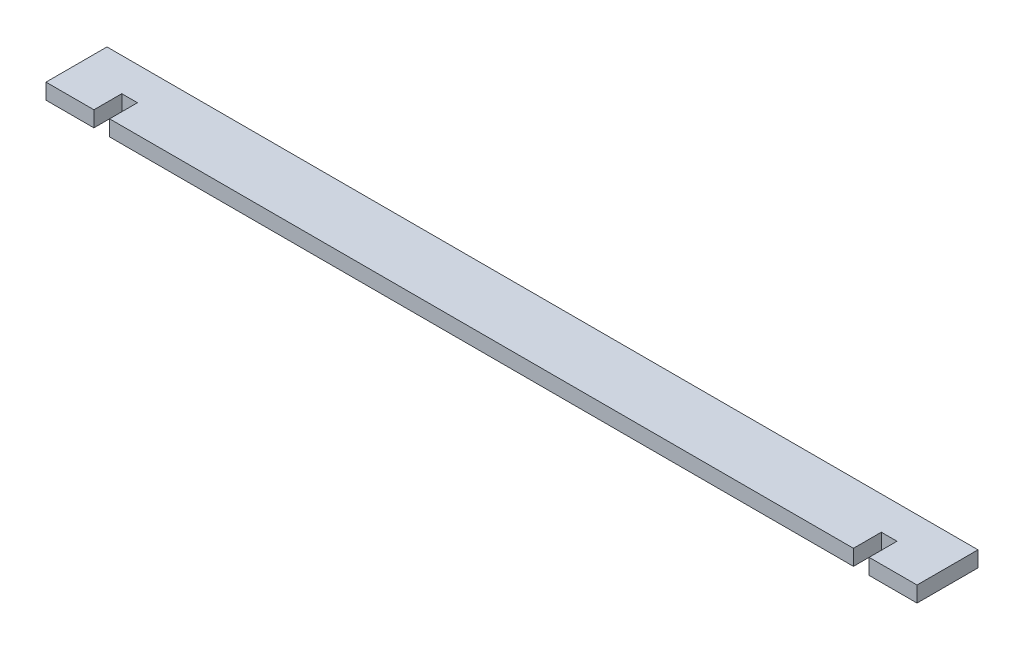
ISO-10303-21;
HEADER;
FILE_DESCRIPTION(('STEP AP214'),'2;1');
FILE_NAME('part.step','',(''),(''),'','','');
FILE_SCHEMA(('AUTOMOTIVE_DESIGN { 1 0 10303 214 1 1 1 1 }'));
ENDSEC;
DATA;
#1=APPLICATION_CONTEXT('core data for automotive mechanical design processes');
#2=APPLICATION_PROTOCOL_DEFINITION('international standard','automotive_design',2000,#1);
#3=PRODUCT_CONTEXT('',#1,'mechanical');
#4=PRODUCT('Part','Part','',(#3));
#5=PRODUCT_RELATED_PRODUCT_CATEGORY('part','',(#4));
#6=PRODUCT_DEFINITION_FORMATION('','',#4);
#7=PRODUCT_DEFINITION_CONTEXT('part definition',#1,'design');
#8=PRODUCT_DEFINITION('design','',#6,#7);
#9=PRODUCT_DEFINITION_SHAPE('','',#8);
#10=(LENGTH_UNIT() NAMED_UNIT(*) SI_UNIT(.MILLI.,.METRE.));
#11=(NAMED_UNIT(*) PLANE_ANGLE_UNIT() SI_UNIT($,.RADIAN.));
#12=(NAMED_UNIT(*) SI_UNIT($,.STERADIAN.) SOLID_ANGLE_UNIT());
#13=UNCERTAINTY_MEASURE_WITH_UNIT(LENGTH_MEASURE(1.E-05),#10,'distance_accuracy_value','');
#14=(GEOMETRIC_REPRESENTATION_CONTEXT(3) GLOBAL_UNCERTAINTY_ASSIGNED_CONTEXT((#13)) GLOBAL_UNIT_ASSIGNED_CONTEXT((#10,
#11,#12)) REPRESENTATION_CONTEXT('',''));
#15=CARTESIAN_POINT('',(0.,0.,0.));
#16=DIRECTION('',(0.,0.,1.));
#17=DIRECTION('',(1.,0.,0.));
#18=AXIS2_PLACEMENT_3D('',#15,#16,#17);
#19=CARTESIAN_POINT('',(0.,18.,0.));
#20=DIRECTION('',(-1.,0.,0.));
#21=DIRECTION('',(0.,0.,1.));
#22=AXIS2_PLACEMENT_3D('',#19,#20,#21);
#23=PLANE('',#22);
#24=DIRECTION('',(0.,0.,-1.));
#25=VECTOR('',#24,1.);
#26=CARTESIAN_POINT('',(0.,0.,0.));
#27=LINE('',#26,#25);
#28=CARTESIAN_POINT('',(0.,0.,0.));
#29=VERTEX_POINT('',#28);
#30=CARTESIAN_POINT('',(0.,0.,-70.0000000000002));
#31=VERTEX_POINT('',#30);
#32=EDGE_CURVE('E153',#29,#31,#27,.T.);
#33=ORIENTED_EDGE('',*,*,#32,.T.);
#34=DIRECTION('',(0.,-1.,0.));
#35=VECTOR('',#34,1.);
#36=CARTESIAN_POINT('',(0.,18.,-70.0000000000002));
#37=LINE('',#36,#35);
#38=CARTESIAN_POINT('',(0.,18.,-70.0000000000002));
#39=VERTEX_POINT('',#38);
#40=EDGE_CURVE('E11',#39,#31,#37,.T.);
#41=ORIENTED_EDGE('',*,*,#40,.F.);
#42=DIRECTION('',(0.,0.,-1.));
#43=VECTOR('',#42,1.);
#44=CARTESIAN_POINT('',(0.,18.,0.));
#45=LINE('',#44,#43);
#46=CARTESIAN_POINT('',(0.,18.,0.));
#47=VERTEX_POINT('',#46);
#48=EDGE_CURVE('E175',#47,#39,#45,.T.);
#49=ORIENTED_EDGE('',*,*,#48,.F.);
#50=DIRECTION('',(0.,-1.,0.));
#51=VECTOR('',#50,1.);
#52=CARTESIAN_POINT('',(0.,18.,0.));
#53=LINE('',#52,#51);
#54=EDGE_CURVE('E149',#47,#29,#53,.T.);
#55=ORIENTED_EDGE('',*,*,#54,.T.);
#56=EDGE_LOOP('',(#33,#41,#49,#55));
#57=FACE_BOUND('',#56,.T.);
#58=ADVANCED_FACE('F33',(#57),#23,.F.);
#59=CARTESIAN_POINT('',(0.,18.,-70.0000000000002));
#60=DIRECTION('',(0.,0.,1.));
#61=DIRECTION('',(1.,0.,0.));
#62=AXIS2_PLACEMENT_3D('',#59,#60,#61);
#63=PLANE('',#62);
#64=DIRECTION('',(-1.,0.,0.));
#65=VECTOR('',#64,1.);
#66=CARTESIAN_POINT('',(0.,0.,-70.0000000000002));
#67=LINE('',#66,#65);
#68=CARTESIAN_POINT('',(-1000.,0.,-70.));
#69=VERTEX_POINT('',#68);
#70=EDGE_CURVE('E156',#31,#69,#67,.T.);
#71=ORIENTED_EDGE('',*,*,#70,.T.);
#72=DIRECTION('',(0.,-1.,0.));
#73=VECTOR('',#72,1.);
#74=CARTESIAN_POINT('',(-1000.,18.,-70.));
#75=LINE('',#74,#73);
#76=CARTESIAN_POINT('',(-1000.,18.,-70.));
#77=VERTEX_POINT('',#76);
#78=EDGE_CURVE('E41',#77,#69,#75,.T.);
#79=ORIENTED_EDGE('',*,*,#78,.F.);
#80=DIRECTION('',(-1.,0.,0.));
#81=VECTOR('',#80,1.);
#82=CARTESIAN_POINT('',(0.,18.,-70.0000000000002));
#83=LINE('',#82,#81);
#84=EDGE_CURVE('E104',#39,#77,#83,.T.);
#85=ORIENTED_EDGE('',*,*,#84,.F.);
#86=ORIENTED_EDGE('',*,*,#40,.T.);
#87=EDGE_LOOP('',(#71,#79,#85,#86));
#88=FACE_BOUND('',#87,.T.);
#89=ADVANCED_FACE('F253',(#88),#63,.F.);
#90=CARTESIAN_POINT('',(-1000.,18.,1.08993565124114E-13));
#91=DIRECTION('',(1.,0.,0.));
#92=DIRECTION('',(0.,0.,-1.));
#93=AXIS2_PLACEMENT_3D('',#90,#91,#92);
#94=PLANE('',#93);
#95=DIRECTION('',(0.,0.,1.));
#96=VECTOR('',#95,1.);
#97=CARTESIAN_POINT('',(-1000.,0.,1.08993565124114E-13));
#98=LINE('',#97,#96);
#99=CARTESIAN_POINT('',(-1000.,0.,1.08993565124114E-13));
#100=VERTEX_POINT('',#99);
#101=EDGE_CURVE('E158',#69,#100,#98,.T.);
#102=ORIENTED_EDGE('',*,*,#101,.T.);
#103=DIRECTION('',(0.,-1.,0.));
#104=VECTOR('',#103,1.);
#105=CARTESIAN_POINT('',(-1000.,18.,1.08993565124114E-13));
#106=LINE('',#105,#104);
#107=CARTESIAN_POINT('',(-1000.,18.,1.08993565124114E-13));
#108=VERTEX_POINT('',#107);
#109=EDGE_CURVE('E194',#108,#100,#106,.T.);
#110=ORIENTED_EDGE('',*,*,#109,.F.);
#111=DIRECTION('',(0.,0.,1.));
#112=VECTOR('',#111,1.);
#113=CARTESIAN_POINT('',(-1000.,18.,1.08993565124114E-13));
#114=LINE('',#113,#112);
#115=EDGE_CURVE('E202',#77,#108,#114,.T.);
#116=ORIENTED_EDGE('',*,*,#115,.F.);
#117=ORIENTED_EDGE('',*,*,#78,.T.);
#118=EDGE_LOOP('',(#102,#110,#116,#117));
#119=FACE_BOUND('',#118,.T.);
#120=ADVANCED_FACE('F200',(#119),#94,.F.);
#121=CARTESIAN_POINT('',(-945.,18.,1.15729122519425E-13));
#122=DIRECTION('',(0.,0.,-1.));
#123=DIRECTION('',(-1.,0.,0.));
#124=AXIS2_PLACEMENT_3D('',#121,#122,#123);
#125=PLANE('',#124);
#126=DIRECTION('',(1.,0.,0.));
#127=VECTOR('',#126,1.);
#128=CARTESIAN_POINT('',(-945.,0.,1.15729122519425E-13));
#129=LINE('',#128,#127);
#130=CARTESIAN_POINT('',(-945.,0.,1.15729122519425E-13));
#131=VERTEX_POINT('',#130);
#132=EDGE_CURVE('E160',#100,#131,#129,.T.);
#133=ORIENTED_EDGE('',*,*,#132,.T.);
#134=DIRECTION('',(0.,-1.,0.));
#135=VECTOR('',#134,1.);
#136=CARTESIAN_POINT('',(-945.,18.,1.15729122519425E-13));
#137=LINE('',#136,#135);
#138=CARTESIAN_POINT('',(-945.,18.,1.15729122519425E-13));
#139=VERTEX_POINT('',#138);
#140=EDGE_CURVE('E191',#139,#131,#137,.T.);
#141=ORIENTED_EDGE('',*,*,#140,.F.);
#142=DIRECTION('',(1.,0.,0.));
#143=VECTOR('',#142,1.);
#144=CARTESIAN_POINT('',(-945.,18.,1.15729122519425E-13));
#145=LINE('',#144,#143);
#146=EDGE_CURVE('E220',#108,#139,#145,.T.);
#147=ORIENTED_EDGE('',*,*,#146,.F.);
#148=ORIENTED_EDGE('',*,*,#109,.T.);
#149=EDGE_LOOP('',(#133,#141,#147,#148));
#150=FACE_BOUND('',#149,.T.);
#151=ADVANCED_FACE('F211',(#150),#125,.F.);
#152=CARTESIAN_POINT('',(-945.,18.,1.15729122519425E-13));
#153=DIRECTION('',(-1.,0.,0.));
#154=DIRECTION('',(0.,0.,1.));
#155=AXIS2_PLACEMENT_3D('',#152,#153,#154);
#156=PLANE('',#155);
#157=DIRECTION('',(0.,0.,-1.));
#158=VECTOR('',#157,1.);
#159=CARTESIAN_POINT('',(-945.,0.,1.15729122519425E-13));
#160=LINE('',#159,#158);
#161=CARTESIAN_POINT('',(-945.,0.,-31.9999999999999));
#162=VERTEX_POINT('',#161);
#163=EDGE_CURVE('E162',#131,#162,#160,.T.);
#164=ORIENTED_EDGE('',*,*,#163,.T.);
#165=DIRECTION('',(0.,-1.,0.));
#166=VECTOR('',#165,1.);
#167=CARTESIAN_POINT('',(-945.,18.,-31.9999999999999));
#168=LINE('',#167,#166);
#169=CARTESIAN_POINT('',(-945.,18.,-31.9999999999999));
#170=VERTEX_POINT('',#169);
#171=EDGE_CURVE('E188',#170,#162,#168,.T.);
#172=ORIENTED_EDGE('',*,*,#171,.F.);
#173=DIRECTION('',(0.,0.,-1.));
#174=VECTOR('',#173,1.);
#175=CARTESIAN_POINT('',(-945.,18.,1.15729122519425E-13));
#176=LINE('',#175,#174);
#177=EDGE_CURVE('E217',#139,#170,#176,.T.);
#178=ORIENTED_EDGE('',*,*,#177,.F.);
#179=ORIENTED_EDGE('',*,*,#140,.T.);
#180=EDGE_LOOP('',(#164,#172,#178,#179));
#181=FACE_BOUND('',#180,.T.);
#182=ADVANCED_FACE('F215',(#181),#156,.F.);
#183=CARTESIAN_POINT('',(-945.,18.,-31.9999999999999));
#184=DIRECTION('',(0.,0.,-1.));
#185=DIRECTION('',(-1.,0.,0.));
#186=AXIS2_PLACEMENT_3D('',#183,#184,#185);
#187=PLANE('',#186);
#188=DIRECTION('',(1.,0.,0.));
#189=VECTOR('',#188,1.);
#190=CARTESIAN_POINT('',(-945.,0.,-31.9999999999999));
#191=LINE('',#190,#189);
#192=CARTESIAN_POINT('',(-927.,0.,-31.9999999999999));
#193=VERTEX_POINT('',#192);
#194=EDGE_CURVE('E164',#162,#193,#191,.T.);
#195=ORIENTED_EDGE('',*,*,#194,.T.);
#196=DIRECTION('',(0.,-1.,0.));
#197=VECTOR('',#196,1.);
#198=CARTESIAN_POINT('',(-927.,18.,-31.9999999999999));
#199=LINE('',#198,#197);
#200=CARTESIAN_POINT('',(-927.,18.,-31.9999999999999));
#201=VERTEX_POINT('',#200);
#202=EDGE_CURVE('E185',#201,#193,#199,.T.);
#203=ORIENTED_EDGE('',*,*,#202,.F.);
#204=DIRECTION('',(1.,0.,0.));
#205=VECTOR('',#204,1.);
#206=CARTESIAN_POINT('',(-945.,18.,-31.9999999999999));
#207=LINE('',#206,#205);
#208=EDGE_CURVE('E219',#170,#201,#207,.T.);
#209=ORIENTED_EDGE('',*,*,#208,.F.);
#210=ORIENTED_EDGE('',*,*,#171,.T.);
#211=EDGE_LOOP('',(#195,#203,#209,#210));
#212=FACE_BOUND('',#211,.T.);
#213=ADVANCED_FACE('F266',(#212),#187,.F.);
#214=CARTESIAN_POINT('',(-927.,18.,1.15729122519425E-13));
#215=DIRECTION('',(1.,0.,0.));
#216=DIRECTION('',(0.,0.,-1.));
#217=AXIS2_PLACEMENT_3D('',#214,#215,#216);
#218=PLANE('',#217);
#219=DIRECTION('',(0.,0.,1.));
#220=VECTOR('',#219,1.);
#221=CARTESIAN_POINT('',(-927.,0.,1.15729122519425E-13));
#222=LINE('',#221,#220);
#223=CARTESIAN_POINT('',(-927.,0.,1.15729122519425E-13));
#224=VERTEX_POINT('',#223);
#225=EDGE_CURVE('E166',#193,#224,#222,.T.);
#226=ORIENTED_EDGE('',*,*,#225,.T.);
#227=DIRECTION('',(0.,-1.,0.));
#228=VECTOR('',#227,1.);
#229=CARTESIAN_POINT('',(-927.,18.,1.15729122519425E-13));
#230=LINE('',#229,#228);
#231=CARTESIAN_POINT('',(-927.,18.,1.15729122519425E-13));
#232=VERTEX_POINT('',#231);
#233=EDGE_CURVE('E182',#232,#224,#230,.T.);
#234=ORIENTED_EDGE('',*,*,#233,.F.);
#235=DIRECTION('',(0.,0.,1.));
#236=VECTOR('',#235,1.);
#237=CARTESIAN_POINT('',(-927.,18.,1.15729122519425E-13));
#238=LINE('',#237,#236);
#239=EDGE_CURVE('E222',#201,#232,#238,.T.);
#240=ORIENTED_EDGE('',*,*,#239,.F.);
#241=ORIENTED_EDGE('',*,*,#202,.T.);
#242=EDGE_LOOP('',(#226,#234,#240,#241));
#243=FACE_BOUND('',#242,.T.);
#244=ADVANCED_FACE('F269',(#243),#218,.F.);
#245=CARTESIAN_POINT('',(-73.,18.,1.15729122519425E-13));
#246=DIRECTION('',(0.,0.,-1.));
#247=DIRECTION('',(-1.,0.,0.));
#248=AXIS2_PLACEMENT_3D('',#245,#246,#247);
#249=PLANE('',#248);
#250=DIRECTION('',(1.,0.,0.));
#251=VECTOR('',#250,1.);
#252=CARTESIAN_POINT('',(-73.,0.,1.15729122519425E-13));
#253=LINE('',#252,#251);
#254=CARTESIAN_POINT('',(-73.,0.,1.15729122519425E-13));
#255=VERTEX_POINT('',#254);
#256=EDGE_CURVE('E168',#224,#255,#253,.T.);
#257=ORIENTED_EDGE('',*,*,#256,.T.);
#258=DIRECTION('',(0.,-1.,0.));
#259=VECTOR('',#258,1.);
#260=CARTESIAN_POINT('',(-73.,18.,1.15729122519425E-13));
#261=LINE('',#260,#259);
#262=CARTESIAN_POINT('',(-73.,18.,1.15729122519425E-13));
#263=VERTEX_POINT('',#262);
#264=EDGE_CURVE('E179',#263,#255,#261,.T.);
#265=ORIENTED_EDGE('',*,*,#264,.F.);
#266=DIRECTION('',(1.,0.,0.));
#267=VECTOR('',#266,1.);
#268=CARTESIAN_POINT('',(-73.,18.,1.15729122519425E-13));
#269=LINE('',#268,#267);
#270=EDGE_CURVE('E228',#232,#263,#269,.T.);
#271=ORIENTED_EDGE('',*,*,#270,.F.);
#272=ORIENTED_EDGE('',*,*,#233,.T.);
#273=EDGE_LOOP('',(#257,#265,#271,#272));
#274=FACE_BOUND('',#273,.T.);
#275=ADVANCED_FACE('F234',(#274),#249,.F.);
#276=CARTESIAN_POINT('',(-73.,18.,1.15729122519425E-13));
#277=DIRECTION('',(-1.,0.,0.));
#278=DIRECTION('',(0.,0.,1.));
#279=AXIS2_PLACEMENT_3D('',#276,#277,#278);
#280=PLANE('',#279);
#281=DIRECTION('',(0.,0.,-1.));
#282=VECTOR('',#281,1.);
#283=CARTESIAN_POINT('',(-73.,0.,1.15729122519425E-13));
#284=LINE('',#283,#282);
#285=CARTESIAN_POINT('',(-73.,0.,-31.9999999999999));
#286=VERTEX_POINT('',#285);
#287=EDGE_CURVE('E170',#255,#286,#284,.T.);
#288=ORIENTED_EDGE('',*,*,#287,.T.);
#289=DIRECTION('',(0.,-1.,0.));
#290=VECTOR('',#289,1.);
#291=CARTESIAN_POINT('',(-73.,18.,-31.9999999999999));
#292=LINE('',#291,#290);
#293=CARTESIAN_POINT('',(-73.,18.,-31.9999999999999));
#294=VERTEX_POINT('',#293);
#295=EDGE_CURVE('E144',#294,#286,#292,.T.);
#296=ORIENTED_EDGE('',*,*,#295,.F.);
#297=DIRECTION('',(0.,0.,-1.));
#298=VECTOR('',#297,1.);
#299=CARTESIAN_POINT('',(-73.,18.,1.15729122519425E-13));
#300=LINE('',#299,#298);
#301=EDGE_CURVE('E135',#263,#294,#300,.T.);
#302=ORIENTED_EDGE('',*,*,#301,.F.);
#303=ORIENTED_EDGE('',*,*,#264,.T.);
#304=EDGE_LOOP('',(#288,#296,#302,#303));
#305=FACE_BOUND('',#304,.T.);
#306=ADVANCED_FACE('F238',(#305),#280,.F.);
#307=CARTESIAN_POINT('',(-54.9999999999999,18.,-31.9999999999999));
#308=DIRECTION('',(0.,0.,-1.));
#309=DIRECTION('',(-1.,0.,0.));
#310=AXIS2_PLACEMENT_3D('',#307,#308,#309);
#311=PLANE('',#310);
#312=DIRECTION('',(1.,0.,0.));
#313=VECTOR('',#312,1.);
#314=CARTESIAN_POINT('',(-54.9999999999999,0.,-31.9999999999999));
#315=LINE('',#314,#313);
#316=CARTESIAN_POINT('',(-54.9999999999999,0.,-31.9999999999999));
#317=VERTEX_POINT('',#316);
#318=EDGE_CURVE('E143',#286,#317,#315,.T.);
#319=ORIENTED_EDGE('',*,*,#318,.T.);
#320=DIRECTION('',(0.,-1.,0.));
#321=VECTOR('',#320,1.);
#322=CARTESIAN_POINT('',(-54.9999999999999,18.,-31.9999999999999));
#323=LINE('',#322,#321);
#324=CARTESIAN_POINT('',(-54.9999999999999,18.,-31.9999999999999));
#325=VERTEX_POINT('',#324);
#326=EDGE_CURVE('E140',#325,#317,#323,.T.);
#327=ORIENTED_EDGE('',*,*,#326,.F.);
#328=DIRECTION('',(1.,0.,0.));
#329=VECTOR('',#328,1.);
#330=CARTESIAN_POINT('',(-54.9999999999999,18.,-31.9999999999999));
#331=LINE('',#330,#329);
#332=EDGE_CURVE('E129',#294,#325,#331,.T.);
#333=ORIENTED_EDGE('',*,*,#332,.F.);
#334=ORIENTED_EDGE('',*,*,#295,.T.);
#335=EDGE_LOOP('',(#319,#327,#333,#334));
#336=FACE_BOUND('',#335,.T.);
#337=ADVANCED_FACE('F141',(#336),#311,.F.);
#338=CARTESIAN_POINT('',(-54.9999999999999,18.,1.15729122519425E-13));
#339=DIRECTION('',(1.,0.,0.));
#340=DIRECTION('',(0.,0.,-1.));
#341=AXIS2_PLACEMENT_3D('',#338,#339,#340);
#342=PLANE('',#341);
#343=DIRECTION('',(0.,0.,1.));
#344=VECTOR('',#343,1.);
#345=CARTESIAN_POINT('',(-54.9999999999999,0.,1.15729122519425E-13));
#346=LINE('',#345,#344);
#347=CARTESIAN_POINT('',(-54.9999999999999,0.,1.15729122519425E-13));
#348=VERTEX_POINT('',#347);
#349=EDGE_CURVE('E90',#317,#348,#346,.T.);
#350=ORIENTED_EDGE('',*,*,#349,.T.);
#351=DIRECTION('',(0.,-1.,0.));
#352=VECTOR('',#351,1.);
#353=CARTESIAN_POINT('',(-54.9999999999999,18.,1.15729122519425E-13));
#354=LINE('',#353,#352);
#355=CARTESIAN_POINT('',(-54.9999999999999,18.,1.15729122519425E-13));
#356=VERTEX_POINT('',#355);
#357=EDGE_CURVE('E145',#356,#348,#354,.T.);
#358=ORIENTED_EDGE('',*,*,#357,.F.);
#359=DIRECTION('',(0.,0.,1.));
#360=VECTOR('',#359,1.);
#361=CARTESIAN_POINT('',(-54.9999999999999,18.,1.15729122519425E-13));
#362=LINE('',#361,#360);
#363=EDGE_CURVE('E133',#325,#356,#362,.T.);
#364=ORIENTED_EDGE('',*,*,#363,.F.);
#365=ORIENTED_EDGE('',*,*,#326,.T.);
#366=EDGE_LOOP('',(#350,#358,#364,#365));
#367=FACE_BOUND('',#366,.T.);
#368=ADVANCED_FACE('F147',(#367),#342,.F.);
#369=CARTESIAN_POINT('',(0.,18.,0.));
#370=DIRECTION('',(0.,0.,-1.));
#371=DIRECTION('',(-1.,0.,0.));
#372=AXIS2_PLACEMENT_3D('',#369,#370,#371);
#373=PLANE('',#372);
#374=DIRECTION('',(1.,0.,0.));
#375=VECTOR('',#374,1.);
#376=CARTESIAN_POINT('',(0.,0.,0.));
#377=LINE('',#376,#375);
#378=EDGE_CURVE('E96',#348,#29,#377,.T.);
#379=ORIENTED_EDGE('',*,*,#378,.T.);
#380=ORIENTED_EDGE('',*,*,#54,.F.);
#381=DIRECTION('',(1.,0.,0.));
#382=VECTOR('',#381,1.);
#383=CARTESIAN_POINT('',(0.,18.,0.));
#384=LINE('',#383,#382);
#385=EDGE_CURVE('E49',#356,#47,#384,.T.);
#386=ORIENTED_EDGE('',*,*,#385,.F.);
#387=ORIENTED_EDGE('',*,*,#357,.T.);
#388=EDGE_LOOP('',(#379,#380,#386,#387));
#389=FACE_BOUND('',#388,.T.);
#390=ADVANCED_FACE('F242',(#389),#373,.F.);
#391=CARTESIAN_POINT('',(0.,18.,0.));
#392=DIRECTION('',(0.,1.,0.));
#393=DIRECTION('',(0.,0.,1.));
#394=AXIS2_PLACEMENT_3D('',#391,#392,#393);
#395=PLANE('',#394);
#396=ORIENTED_EDGE('',*,*,#48,.T.);
#397=ORIENTED_EDGE('',*,*,#84,.T.);
#398=ORIENTED_EDGE('',*,*,#115,.T.);
#399=ORIENTED_EDGE('',*,*,#146,.T.);
#400=ORIENTED_EDGE('',*,*,#177,.T.);
#401=ORIENTED_EDGE('',*,*,#208,.T.);
#402=ORIENTED_EDGE('',*,*,#239,.T.);
#403=ORIENTED_EDGE('',*,*,#270,.T.);
#404=ORIENTED_EDGE('',*,*,#301,.T.);
#405=ORIENTED_EDGE('',*,*,#332,.T.);
#406=ORIENTED_EDGE('',*,*,#363,.T.);
#407=ORIENTED_EDGE('',*,*,#385,.T.);
#408=EDGE_LOOP('',(#396,#397,#398,#399,#400,#401,#402,#403,#404,#405,#406,#407));
#409=FACE_BOUND('',#408,.T.);
#410=ADVANCED_FACE('F131',(#409),#395,.T.);
#411=CARTESIAN_POINT('',(0.,0.,0.));
#412=DIRECTION('',(0.,1.,0.));
#413=DIRECTION('',(0.,0.,1.));
#414=AXIS2_PLACEMENT_3D('',#411,#412,#413);
#415=PLANE('',#414);
#416=ORIENTED_EDGE('',*,*,#32,.F.);
#417=ORIENTED_EDGE('',*,*,#378,.F.);
#418=ORIENTED_EDGE('',*,*,#349,.F.);
#419=ORIENTED_EDGE('',*,*,#318,.F.);
#420=ORIENTED_EDGE('',*,*,#287,.F.);
#421=ORIENTED_EDGE('',*,*,#256,.F.);
#422=ORIENTED_EDGE('',*,*,#225,.F.);
#423=ORIENTED_EDGE('',*,*,#194,.F.);
#424=ORIENTED_EDGE('',*,*,#163,.F.);
#425=ORIENTED_EDGE('',*,*,#132,.F.);
#426=ORIENTED_EDGE('',*,*,#101,.F.);
#427=ORIENTED_EDGE('',*,*,#70,.F.);
#428=EDGE_LOOP('',(#416,#417,#418,#419,#420,#421,#422,#423,#424,#425,#426,#427));
#429=FACE_BOUND('',#428,.T.);
#430=ADVANCED_FACE('F206',(#429),#415,.F.);
#431=CLOSED_SHELL('',(#58,#89,#120,#151,#182,#213,#244,#275,#306,#337,#368,#390,#410,#430));
#432=MANIFOLD_SOLID_BREP('B2',#431);
#433=ADVANCED_BREP_SHAPE_REPRESENTATION('',(#18,#432),#14);
#434=SHAPE_DEFINITION_REPRESENTATION(#9,#433);
ENDSEC;
END-ISO-10303-21;
